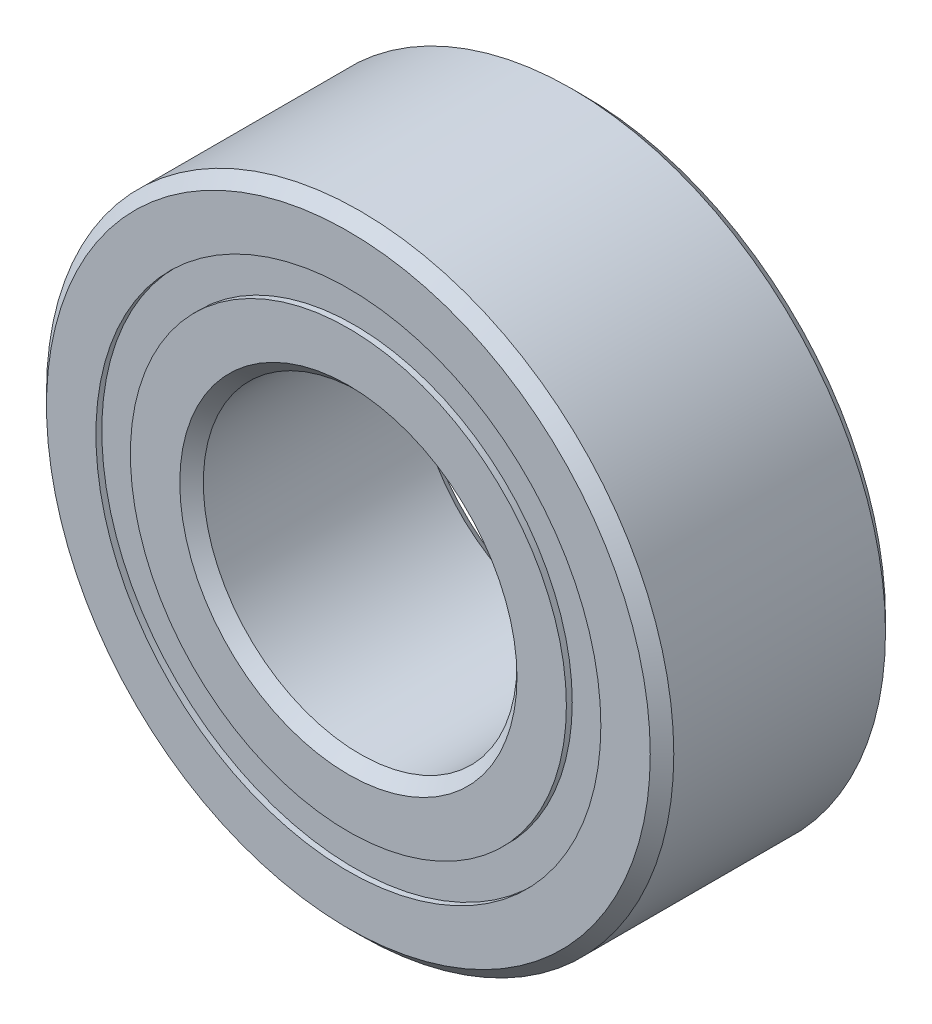
ISO-10303-21;
HEADER;
FILE_DESCRIPTION(('STEP AP214'),'2;1');
FILE_NAME('part.step','',(''),(''),'','','');
FILE_SCHEMA(('AUTOMOTIVE_DESIGN { 1 0 10303 214 1 1 1 1 }'));
ENDSEC;
DATA;
#1=APPLICATION_CONTEXT('core data for automotive mechanical design processes');
#2=APPLICATION_PROTOCOL_DEFINITION('international standard','automotive_design',2000,#1);
#3=PRODUCT_CONTEXT('',#1,'mechanical');
#4=PRODUCT('Part','Part','',(#3));
#5=PRODUCT_RELATED_PRODUCT_CATEGORY('part','',(#4));
#6=PRODUCT_DEFINITION_FORMATION('','',#4);
#7=PRODUCT_DEFINITION_CONTEXT('part definition',#1,'design');
#8=PRODUCT_DEFINITION('design','',#6,#7);
#9=PRODUCT_DEFINITION_SHAPE('','',#8);
#10=(LENGTH_UNIT() NAMED_UNIT(*) SI_UNIT(.MILLI.,.METRE.));
#11=(NAMED_UNIT(*) PLANE_ANGLE_UNIT() SI_UNIT($,.RADIAN.));
#12=(NAMED_UNIT(*) SI_UNIT($,.STERADIAN.) SOLID_ANGLE_UNIT());
#13=UNCERTAINTY_MEASURE_WITH_UNIT(LENGTH_MEASURE(1.E-05),#10,'distance_accuracy_value','');
#14=(GEOMETRIC_REPRESENTATION_CONTEXT(3) GLOBAL_UNCERTAINTY_ASSIGNED_CONTEXT((#13)) GLOBAL_UNIT_ASSIGNED_CONTEXT((#10,
#11,#12)) REPRESENTATION_CONTEXT('',''));
#15=CARTESIAN_POINT('',(0.,0.,0.));
#16=DIRECTION('',(0.,0.,1.));
#17=DIRECTION('',(1.,0.,0.));
#18=AXIS2_PLACEMENT_3D('',#15,#16,#17);
#19=CARTESIAN_POINT('',(0.,5.1114010989011,-2.2621875));
#20=DIRECTION('',(0.,0.,1.));
#21=DIRECTION('',(1.,0.,0.));
#22=AXIS2_PLACEMENT_3D('',#19,#20,#21);
#23=PLANE('',#22);
#24=CARTESIAN_POINT('',(0.,0.,-2.2621875));
#25=DIRECTION('',(0.,0.,1.));
#26=DIRECTION('',(1.,0.,0.));
#27=AXIS2_PLACEMENT_3D('',#24,#25,#26);
#28=CIRCLE('',#27,5.1114010989011);
#29=CARTESIAN_POINT('',(5.1114010989011,0.,-2.2621875));
#30=VERTEX_POINT('',#29);
#31=EDGE_CURVE('E60',#30,#30,#28,.T.);
#32=ORIENTED_EDGE('',*,*,#31,.F.);
#33=EDGE_LOOP('',(#32));
#34=FACE_BOUND('',#33,.T.);
#35=CARTESIAN_POINT('',(0.,0.,-2.2621875));
#36=DIRECTION('',(0.,0.,1.));
#37=DIRECTION('',(1.,0.,0.));
#38=AXIS2_PLACEMENT_3D('',#35,#36,#37);
#39=CIRCLE('',#38,4.4135989010989);
#40=CARTESIAN_POINT('',(4.4135989010989,0.,-2.2621875));
#41=VERTEX_POINT('',#40);
#42=EDGE_CURVE('E11',#41,#41,#39,.T.);
#43=ORIENTED_EDGE('',*,*,#42,.T.);
#44=EDGE_LOOP('',(#43));
#45=FACE_BOUND('',#44,.T.);
#46=ADVANCED_FACE('F46',(#34,#45),#23,.F.);
#47=CARTESIAN_POINT('',(0.,0.,2.38125));
#48=DIRECTION('',(0.,0.,1.));
#49=DIRECTION('',(1.,0.,0.));
#50=AXIS2_PLACEMENT_3D('',#47,#48,#49);
#51=CYLINDRICAL_SURFACE('',#50,4.4135989010989);
#52=ORIENTED_EDGE('',*,*,#42,.F.);
#53=EDGE_LOOP('',(#52));
#54=FACE_BOUND('',#53,.T.);
#55=CARTESIAN_POINT('',(0.,0.,-1.11436144103197));
#56=DIRECTION('',(0.,0.,1.));
#57=DIRECTION('',(1.,0.,0.));
#58=AXIS2_PLACEMENT_3D('',#55,#56,#57);
#59=CIRCLE('',#58,4.4135989010989);
#60=CARTESIAN_POINT('',(4.4135989010989,0.,-1.11436144103197));
#61=VERTEX_POINT('',#60);
#62=EDGE_CURVE('E52',#61,#61,#59,.T.);
#63=ORIENTED_EDGE('',*,*,#62,.T.);
#64=EDGE_LOOP('',(#63));
#65=FACE_BOUND('',#64,.T.);
#66=ADVANCED_FACE('F69',(#54,#65),#51,.F.);
#67=CARTESIAN_POINT('',(0.,5.1114010989011,-1.11436144103197));
#68=DIRECTION('',(0.,0.,-1.));
#69=DIRECTION('',(-1.,0.,0.));
#70=AXIS2_PLACEMENT_3D('',#67,#68,#69);
#71=PLANE('',#70);
#72=ORIENTED_EDGE('',*,*,#62,.F.);
#73=EDGE_LOOP('',(#72));
#74=FACE_BOUND('',#73,.T.);
#75=CARTESIAN_POINT('',(0.,0.,-1.11436144103197));
#76=DIRECTION('',(0.,0.,1.));
#77=DIRECTION('',(1.,0.,0.));
#78=AXIS2_PLACEMENT_3D('',#75,#76,#77);
#79=CIRCLE('',#78,5.1114010989011);
#80=CARTESIAN_POINT('',(5.1114010989011,0.,-1.11436144103197));
#81=VERTEX_POINT('',#80);
#82=EDGE_CURVE('E56',#81,#81,#79,.T.);
#83=ORIENTED_EDGE('',*,*,#82,.T.);
#84=EDGE_LOOP('',(#83));
#85=FACE_BOUND('',#84,.T.);
#86=ADVANCED_FACE('F73',(#74,#85),#71,.F.);
#87=CARTESIAN_POINT('',(0.,0.,2.38125));
#88=DIRECTION('',(0.,0.,1.));
#89=DIRECTION('',(1.,0.,0.));
#90=AXIS2_PLACEMENT_3D('',#87,#88,#89);
#91=CYLINDRICAL_SURFACE('',#90,5.1114010989011);
#92=ORIENTED_EDGE('',*,*,#82,.F.);
#93=EDGE_LOOP('',(#92));
#94=FACE_BOUND('',#93,.T.);
#95=ORIENTED_EDGE('',*,*,#31,.T.);
#96=EDGE_LOOP('',(#95));
#97=FACE_BOUND('',#96,.T.);
#98=ADVANCED_FACE('F66',(#94,#97),#91,.T.);
#99=CLOSED_SHELL('',(#46,#66,#86,#98));
#100=MANIFOLD_SOLID_BREP('B2',#99);
#101=CARTESIAN_POINT('',(0.,5.1114010989011,2.2621875));
#102=DIRECTION('',(0.,0.,-1.));
#103=DIRECTION('',(-1.,0.,0.));
#104=AXIS2_PLACEMENT_3D('',#101,#102,#103);
#105=PLANE('',#104);
#106=CARTESIAN_POINT('',(0.,0.,2.2621875));
#107=DIRECTION('',(0.,0.,1.));
#108=DIRECTION('',(1.,0.,0.));
#109=AXIS2_PLACEMENT_3D('',#106,#107,#108);
#110=CIRCLE('',#109,4.4135989010989);
#111=CARTESIAN_POINT('',(4.4135989010989,0.,2.2621875));
#112=VERTEX_POINT('',#111);
#113=EDGE_CURVE('E45',#112,#112,#110,.T.);
#114=ORIENTED_EDGE('',*,*,#113,.F.);
#115=EDGE_LOOP('',(#114));
#116=FACE_BOUND('',#115,.T.);
#117=CARTESIAN_POINT('',(0.,0.,2.2621875));
#118=DIRECTION('',(0.,0.,1.));
#119=DIRECTION('',(1.,0.,0.));
#120=AXIS2_PLACEMENT_3D('',#117,#118,#119);
#121=CIRCLE('',#120,5.1114010989011);
#122=CARTESIAN_POINT('',(5.1114010989011,0.,2.2621875));
#123=VERTEX_POINT('',#122);
#124=EDGE_CURVE('E128',#123,#123,#121,.T.);
#125=ORIENTED_EDGE('',*,*,#124,.T.);
#126=EDGE_LOOP('',(#125));
#127=FACE_BOUND('',#126,.T.);
#128=ADVANCED_FACE('F114',(#116,#127),#105,.F.);
#129=CARTESIAN_POINT('',(0.,0.,2.38125));
#130=DIRECTION('',(0.,0.,1.));
#131=DIRECTION('',(1.,0.,0.));
#132=AXIS2_PLACEMENT_3D('',#129,#130,#131);
#133=CYLINDRICAL_SURFACE('',#132,4.4135989010989);
#134=CARTESIAN_POINT('',(0.,0.,1.11436144103197));
#135=DIRECTION('',(0.,0.,1.));
#136=DIRECTION('',(1.,0.,0.));
#137=AXIS2_PLACEMENT_3D('',#134,#135,#136);
#138=CIRCLE('',#137,4.4135989010989);
#139=CARTESIAN_POINT('',(4.4135989010989,0.,1.11436144103197));
#140=VERTEX_POINT('',#139);
#141=EDGE_CURVE('E120',#140,#140,#138,.T.);
#142=ORIENTED_EDGE('',*,*,#141,.F.);
#143=EDGE_LOOP('',(#142));
#144=FACE_BOUND('',#143,.T.);
#145=ORIENTED_EDGE('',*,*,#113,.T.);
#146=EDGE_LOOP('',(#145));
#147=FACE_BOUND('',#146,.T.);
#148=ADVANCED_FACE('F143',(#144,#147),#133,.F.);
#149=CARTESIAN_POINT('',(0.,5.1114010989011,1.11436144103197));
#150=DIRECTION('',(0.,0.,1.));
#151=DIRECTION('',(1.,0.,0.));
#152=AXIS2_PLACEMENT_3D('',#149,#150,#151);
#153=PLANE('',#152);
#154=CARTESIAN_POINT('',(0.,0.,1.11436144103197));
#155=DIRECTION('',(0.,0.,1.));
#156=DIRECTION('',(1.,0.,0.));
#157=AXIS2_PLACEMENT_3D('',#154,#155,#156);
#158=CIRCLE('',#157,5.1114010989011);
#159=CARTESIAN_POINT('',(5.1114010989011,0.,1.11436144103197));
#160=VERTEX_POINT('',#159);
#161=EDGE_CURVE('E124',#160,#160,#158,.T.);
#162=ORIENTED_EDGE('',*,*,#161,.F.);
#163=EDGE_LOOP('',(#162));
#164=FACE_BOUND('',#163,.T.);
#165=ORIENTED_EDGE('',*,*,#141,.T.);
#166=EDGE_LOOP('',(#165));
#167=FACE_BOUND('',#166,.T.);
#168=ADVANCED_FACE('F138',(#164,#167),#153,.F.);
#169=CARTESIAN_POINT('',(0.,0.,2.38125));
#170=DIRECTION('',(0.,0.,1.));
#171=DIRECTION('',(1.,0.,0.));
#172=AXIS2_PLACEMENT_3D('',#169,#170,#171);
#173=CYLINDRICAL_SURFACE('',#172,5.1114010989011);
#174=ORIENTED_EDGE('',*,*,#124,.F.);
#175=EDGE_LOOP('',(#174));
#176=FACE_BOUND('',#175,.T.);
#177=ORIENTED_EDGE('',*,*,#161,.T.);
#178=EDGE_LOOP('',(#177));
#179=FACE_BOUND('',#178,.T.);
#180=ADVANCED_FACE('F135',(#176,#179),#173,.T.);
#181=CLOSED_SHELL('',(#128,#148,#168,#180));
#182=MANIFOLD_SOLID_BREP('B6',#181);
#183=CARTESIAN_POINT('',(-2.38124999999995,4.12444598552342,0.));
#184=DIRECTION('',(0.,0.,1.));
#185=DIRECTION('',(-0.499999999999989,0.866025403784445,0.));
#186=AXIS2_PLACEMENT_3D('',#183,#184,#185);
#187=SPHERICAL_SURFACE('',#186,1.11436144103197);
#188=CARTESIAN_POINT('',(-2.38124999999995,4.12444598552342,1.11436144103197));
#189=VERTEX_POINT('',#188);
#190=VERTEX_LOOP('',#189);
#191=FACE_BOUND('',#190,.T.);
#192=ADVANCED_FACE('F182',(#191),#187,.T.);
#193=CLOSED_SHELL('',(#192));
#194=MANIFOLD_SOLID_BREP('B40',#193);
#195=CARTESIAN_POINT('',(-4.12444598552336,2.38125000000005,0.));
#196=DIRECTION('',(0.,0.,1.));
#197=DIRECTION('',(-0.866025403784433,0.50000000000001,0.));
#198=AXIS2_PLACEMENT_3D('',#195,#196,#197);
#199=SPHERICAL_SURFACE('',#198,1.11436144103197);
#200=CARTESIAN_POINT('',(-4.12444598552336,2.38125000000005,1.11436144103197));
#201=VERTEX_POINT('',#200);
#202=VERTEX_LOOP('',#201);
#203=FACE_BOUND('',#202,.T.);
#204=ADVANCED_FACE('F203',(#203),#199,.T.);
#205=CLOSED_SHELL('',(#204));
#206=MANIFOLD_SOLID_BREP('B110',#205);
#207=CARTESIAN_POINT('',(-4.7625,0.,0.));
#208=DIRECTION('',(0.,0.,1.));
#209=DIRECTION('',(-1.,0.,0.));
#210=AXIS2_PLACEMENT_3D('',#207,#208,#209);
#211=SPHERICAL_SURFACE('',#210,1.11436144103197);
#212=CARTESIAN_POINT('',(-4.7625,0.,1.11436144103197));
#213=VERTEX_POINT('',#212);
#214=VERTEX_LOOP('',#213);
#215=FACE_BOUND('',#214,.T.);
#216=ADVANCED_FACE('F224',(#215),#211,.T.);
#217=CLOSED_SHELL('',(#216));
#218=MANIFOLD_SOLID_BREP('B178',#217);
#219=CARTESIAN_POINT('',(-4.12444598552341,-2.38124999999996,0.));
#220=DIRECTION('',(0.,0.,1.));
#221=DIRECTION('',(-0.866025403784443,-0.499999999999992,0.));
#222=AXIS2_PLACEMENT_3D('',#219,#220,#221);
#223=SPHERICAL_SURFACE('',#222,1.11436144103197);
#224=CARTESIAN_POINT('',(-4.12444598552341,-2.38124999999996,1.11436144103197));
#225=VERTEX_POINT('',#224);
#226=VERTEX_LOOP('',#225);
#227=FACE_BOUND('',#226,.T.);
#228=ADVANCED_FACE('F245',(#227),#223,.T.);
#229=CLOSED_SHELL('',(#228));
#230=MANIFOLD_SOLID_BREP('B199',#229);
#231=CARTESIAN_POINT('',(-2.38125000000003,-4.12444598552337,0.));
#232=DIRECTION('',(0.,0.,1.));
#233=DIRECTION('',(-0.500000000000007,-0.866025403784435,0.));
#234=AXIS2_PLACEMENT_3D('',#231,#232,#233);
#235=SPHERICAL_SURFACE('',#234,1.11436144103197);
#236=CARTESIAN_POINT('',(-2.38125000000003,-4.12444598552337,1.11436144103197));
#237=VERTEX_POINT('',#236);
#238=VERTEX_LOOP('',#237);
#239=FACE_BOUND('',#238,.T.);
#240=ADVANCED_FACE('F266',(#239),#235,.T.);
#241=CLOSED_SHELL('',(#240));
#242=MANIFOLD_SOLID_BREP('B220',#241);
#243=CARTESIAN_POINT('',(0.,-4.7625,0.));
#244=DIRECTION('',(0.,0.,1.));
#245=DIRECTION('',(0.,-1.,0.));
#246=AXIS2_PLACEMENT_3D('',#243,#244,#245);
#247=SPHERICAL_SURFACE('',#246,1.11436144103197);
#248=CARTESIAN_POINT('',(0.,-4.7625,1.11436144103197));
#249=VERTEX_POINT('',#248);
#250=VERTEX_LOOP('',#249);
#251=FACE_BOUND('',#250,.T.);
#252=ADVANCED_FACE('F287',(#251),#247,.T.);
#253=CLOSED_SHELL('',(#252));
#254=MANIFOLD_SOLID_BREP('B241',#253);
#255=CARTESIAN_POINT('',(2.38124999999998,-4.1244459855234,0.));
#256=DIRECTION('',(0.,0.,1.));
#257=DIRECTION('',(0.499999999999995,-0.866025403784442,0.));
#258=AXIS2_PLACEMENT_3D('',#255,#256,#257);
#259=SPHERICAL_SURFACE('',#258,1.11436144103197);
#260=CARTESIAN_POINT('',(2.38124999999998,-4.1244459855234,1.11436144103197));
#261=VERTEX_POINT('',#260);
#262=VERTEX_LOOP('',#261);
#263=FACE_BOUND('',#262,.T.);
#264=ADVANCED_FACE('F308',(#263),#259,.T.);
#265=CLOSED_SHELL('',(#264));
#266=MANIFOLD_SOLID_BREP('B262',#265);
#267=CARTESIAN_POINT('',(4.12444598552338,-2.38125000000002,0.));
#268=DIRECTION('',(0.,0.,1.));
#269=DIRECTION('',(0.866025403784436,-0.500000000000004,0.));
#270=AXIS2_PLACEMENT_3D('',#267,#268,#269);
#271=SPHERICAL_SURFACE('',#270,1.11436144103197);
#272=CARTESIAN_POINT('',(4.12444598552338,-2.38125000000002,1.11436144103197));
#273=VERTEX_POINT('',#272);
#274=VERTEX_LOOP('',#273);
#275=FACE_BOUND('',#274,.T.);
#276=ADVANCED_FACE('F329',(#275),#271,.T.);
#277=CLOSED_SHELL('',(#276));
#278=MANIFOLD_SOLID_BREP('B283',#277);
#279=CARTESIAN_POINT('',(4.7625,0.,0.));
#280=DIRECTION('',(0.,0.,1.));
#281=DIRECTION('',(1.,0.,0.));
#282=AXIS2_PLACEMENT_3D('',#279,#280,#281);
#283=SPHERICAL_SURFACE('',#282,1.11436144103197);
#284=CARTESIAN_POINT('',(4.7625,0.,1.11436144103197));
#285=VERTEX_POINT('',#284);
#286=VERTEX_LOOP('',#285);
#287=FACE_BOUND('',#286,.T.);
#288=ADVANCED_FACE('F350',(#287),#283,.T.);
#289=CLOSED_SHELL('',(#288));
#290=MANIFOLD_SOLID_BREP('B304',#289);
#291=CARTESIAN_POINT('',(4.12444598552339,2.38124999999999,0.));
#292=DIRECTION('',(0.,0.,1.));
#293=DIRECTION('',(0.86602540378444,0.499999999999998,0.));
#294=AXIS2_PLACEMENT_3D('',#291,#292,#293);
#295=SPHERICAL_SURFACE('',#294,1.11436144103197);
#296=CARTESIAN_POINT('',(4.12444598552339,2.38124999999999,1.11436144103197));
#297=VERTEX_POINT('',#296);
#298=VERTEX_LOOP('',#297);
#299=FACE_BOUND('',#298,.T.);
#300=ADVANCED_FACE('F371',(#299),#295,.T.);
#301=CLOSED_SHELL('',(#300));
#302=MANIFOLD_SOLID_BREP('B325',#301);
#303=CARTESIAN_POINT('',(2.38125,4.12444598552339,0.));
#304=DIRECTION('',(0.,0.,1.));
#305=DIRECTION('',(0.500000000000001,0.866025403784438,0.));
#306=AXIS2_PLACEMENT_3D('',#303,#304,#305);
#307=SPHERICAL_SURFACE('',#306,1.11436144103197);
#308=CARTESIAN_POINT('',(2.38125,4.12444598552339,1.11436144103197));
#309=VERTEX_POINT('',#308);
#310=VERTEX_LOOP('',#309);
#311=FACE_BOUND('',#310,.T.);
#312=ADVANCED_FACE('F392',(#311),#307,.T.);
#313=CLOSED_SHELL('',(#312));
#314=MANIFOLD_SOLID_BREP('B346',#313);
#315=CARTESIAN_POINT('',(0.,4.7625,0.));
#316=DIRECTION('',(0.,0.,1.));
#317=DIRECTION('',(0.,1.,0.));
#318=AXIS2_PLACEMENT_3D('',#315,#316,#317);
#319=SPHERICAL_SURFACE('',#318,1.11436144103197);
#320=CARTESIAN_POINT('',(0.,4.7625,1.11436144103197));
#321=VERTEX_POINT('',#320);
#322=VERTEX_LOOP('',#321);
#323=FACE_BOUND('',#322,.T.);
#324=ADVANCED_FACE('F415',(#323),#319,.T.);
#325=CLOSED_SHELL('',(#324));
#326=MANIFOLD_SOLID_BREP('B367',#325);
#327=CARTESIAN_POINT('',(0.,4.4135989010989,2.38125));
#328=DIRECTION('',(0.,0.,-1.));
#329=DIRECTION('',(-1.,0.,0.));
#330=AXIS2_PLACEMENT_3D('',#327,#328,#329);
#331=PLANE('',#330);
#332=CARTESIAN_POINT('',(0.,0.,2.38125));
#333=DIRECTION('',(0.,0.,1.));
#334=DIRECTION('',(1.,0.,0.));
#335=AXIS2_PLACEMENT_3D('',#332,#333,#334);
#336=CIRCLE('',#335,3.413125);
#337=CARTESIAN_POINT('',(3.413125,0.,2.38125));
#338=VERTEX_POINT('',#337);
#339=EDGE_CURVE('E463',#338,#338,#336,.T.);
#340=ORIENTED_EDGE('',*,*,#339,.F.);
#341=EDGE_LOOP('',(#340));
#342=FACE_BOUND('',#341,.T.);
#343=CARTESIAN_POINT('',(0.,0.,2.38125));
#344=DIRECTION('',(0.,0.,1.));
#345=DIRECTION('',(1.,0.,0.));
#346=AXIS2_PLACEMENT_3D('',#343,#344,#345);
#347=CIRCLE('',#346,4.4135989010989);
#348=CARTESIAN_POINT('',(4.4135989010989,0.,2.38125));
#349=VERTEX_POINT('',#348);
#350=EDGE_CURVE('E414',#349,#349,#347,.T.);
#351=ORIENTED_EDGE('',*,*,#350,.T.);
#352=EDGE_LOOP('',(#351));
#353=FACE_BOUND('',#352,.T.);
#354=ADVANCED_FACE('F435',(#342,#353),#331,.F.);
#355=CARTESIAN_POINT('',(0.,0.,2.38125));
#356=DIRECTION('',(0.,0.,1.));
#357=DIRECTION('',(1.,0.,0.));
#358=AXIS2_PLACEMENT_3D('',#355,#356,#357);
#359=CYLINDRICAL_SURFACE('',#358,4.4135989010989);
#360=ORIENTED_EDGE('',*,*,#350,.F.);
#361=EDGE_LOOP('',(#360));
#362=FACE_BOUND('',#361,.T.);
#363=CARTESIAN_POINT('',(0.,0.,1.05833333333333));
#364=DIRECTION('',(0.,0.,1.));
#365=DIRECTION('',(1.,0.,0.));
#366=AXIS2_PLACEMENT_3D('',#363,#364,#365);
#367=CIRCLE('',#366,4.4135989010989);
#368=CARTESIAN_POINT('',(4.4135989010989,0.,1.05833333333333));
#369=VERTEX_POINT('',#368);
#370=EDGE_CURVE('E441',#369,#369,#367,.T.);
#371=ORIENTED_EDGE('',*,*,#370,.T.);
#372=EDGE_LOOP('',(#371));
#373=FACE_BOUND('',#372,.T.);
#374=ADVANCED_FACE('F470',(#362,#373),#359,.T.);
#375=CARTESIAN_POINT('',(0.,0.,0.));
#376=DIRECTION('',(0.,0.,1.));
#377=DIRECTION('',(1.,0.,0.));
#378=AXIS2_PLACEMENT_3D('',#375,#376,#377);
#379=TOROIDAL_SURFACE('',#378,4.76249999999999,1.11436144103196);
#380=ORIENTED_EDGE('',*,*,#370,.F.);
#381=EDGE_LOOP('',(#380));
#382=FACE_BOUND('',#381,.T.);
#383=CARTESIAN_POINT('',(0.,0.,-1.05833333333334));
#384=DIRECTION('',(0.,0.,1.));
#385=DIRECTION('',(1.,0.,0.));
#386=AXIS2_PLACEMENT_3D('',#383,#384,#385);
#387=CIRCLE('',#386,4.4135989010989);
#388=CARTESIAN_POINT('',(4.4135989010989,0.,-1.05833333333334));
#389=VERTEX_POINT('',#388);
#390=EDGE_CURVE('E445',#389,#389,#387,.T.);
#391=ORIENTED_EDGE('',*,*,#390,.T.);
#392=EDGE_LOOP('',(#391));
#393=FACE_BOUND('',#392,.T.);
#394=ADVANCED_FACE('F474',(#382,#393),#379,.F.);
#395=CARTESIAN_POINT('',(0.,0.,2.38125));
#396=DIRECTION('',(0.,0.,1.));
#397=DIRECTION('',(1.,0.,0.));
#398=AXIS2_PLACEMENT_3D('',#395,#396,#397);
#399=CYLINDRICAL_SURFACE('',#398,4.4135989010989);
#400=ORIENTED_EDGE('',*,*,#390,.F.);
#401=EDGE_LOOP('',(#400));
#402=FACE_BOUND('',#401,.T.);
#403=CARTESIAN_POINT('',(0.,0.,-2.38125));
#404=DIRECTION('',(0.,0.,1.));
#405=DIRECTION('',(1.,0.,0.));
#406=AXIS2_PLACEMENT_3D('',#403,#404,#405);
#407=CIRCLE('',#406,4.4135989010989);
#408=CARTESIAN_POINT('',(4.4135989010989,0.,-2.38125));
#409=VERTEX_POINT('',#408);
#410=EDGE_CURVE('E449',#409,#409,#407,.T.);
#411=ORIENTED_EDGE('',*,*,#410,.T.);
#412=EDGE_LOOP('',(#411));
#413=FACE_BOUND('',#412,.T.);
#414=ADVANCED_FACE('F479',(#402,#413),#399,.T.);
#415=CARTESIAN_POINT('',(0.,3.413125,-2.38125));
#416=DIRECTION('',(0.,0.,1.));
#417=DIRECTION('',(1.,0.,0.));
#418=AXIS2_PLACEMENT_3D('',#415,#416,#417);
#419=PLANE('',#418);
#420=ORIENTED_EDGE('',*,*,#410,.F.);
#421=EDGE_LOOP('',(#420));
#422=FACE_BOUND('',#421,.T.);
#423=CARTESIAN_POINT('',(0.,0.,-2.38125));
#424=DIRECTION('',(0.,0.,1.));
#425=DIRECTION('',(1.,0.,0.));
#426=AXIS2_PLACEMENT_3D('',#423,#424,#425);
#427=CIRCLE('',#426,3.413125);
#428=CARTESIAN_POINT('',(3.413125,0.,-2.38125));
#429=VERTEX_POINT('',#428);
#430=EDGE_CURVE('E454',#429,#429,#427,.T.);
#431=ORIENTED_EDGE('',*,*,#430,.T.);
#432=EDGE_LOOP('',(#431));
#433=FACE_BOUND('',#432,.T.);
#434=ADVANCED_FACE('F485',(#422,#433),#419,.F.);
#435=CARTESIAN_POINT('',(0.,0.,-2.143125));
#436=DIRECTION('',(0.,0.,-1.));
#437=DIRECTION('',(-1.,0.,0.));
#438=AXIS2_PLACEMENT_3D('',#435,#436,#437);
#439=CONICAL_SURFACE('',#438,3.175,0.785398163397451);
#440=ORIENTED_EDGE('',*,*,#430,.F.);
#441=EDGE_LOOP('',(#440));
#442=FACE_BOUND('',#441,.T.);
#443=CARTESIAN_POINT('',(0.,0.,-2.143125));
#444=DIRECTION('',(0.,0.,1.));
#445=DIRECTION('',(1.,0.,0.));
#446=AXIS2_PLACEMENT_3D('',#443,#444,#445);
#447=CIRCLE('',#446,3.175);
#448=CARTESIAN_POINT('',(3.175,0.,-2.143125));
#449=VERTEX_POINT('',#448);
#450=EDGE_CURVE('E457',#449,#449,#447,.T.);
#451=ORIENTED_EDGE('',*,*,#450,.T.);
#452=EDGE_LOOP('',(#451));
#453=FACE_BOUND('',#452,.T.);
#454=ADVANCED_FACE('F489',(#442,#453),#439,.F.);
#455=CARTESIAN_POINT('',(0.,0.,2.38125));
#456=DIRECTION('',(0.,0.,1.));
#457=DIRECTION('',(1.,0.,0.));
#458=AXIS2_PLACEMENT_3D('',#455,#456,#457);
#459=CYLINDRICAL_SURFACE('',#458,3.175);
#460=ORIENTED_EDGE('',*,*,#450,.F.);
#461=EDGE_LOOP('',(#460));
#462=FACE_BOUND('',#461,.T.);
#463=CARTESIAN_POINT('',(0.,0.,2.143125));
#464=DIRECTION('',(0.,0.,1.));
#465=DIRECTION('',(1.,0.,0.));
#466=AXIS2_PLACEMENT_3D('',#463,#464,#465);
#467=CIRCLE('',#466,3.175);
#468=CARTESIAN_POINT('',(3.175,0.,2.143125));
#469=VERTEX_POINT('',#468);
#470=EDGE_CURVE('E460',#469,#469,#467,.T.);
#471=ORIENTED_EDGE('',*,*,#470,.T.);
#472=EDGE_LOOP('',(#471));
#473=FACE_BOUND('',#472,.T.);
#474=ADVANCED_FACE('F493',(#462,#473),#459,.F.);
#475=CARTESIAN_POINT('',(0.,0.,2.38125));
#476=DIRECTION('',(0.,0.,1.));
#477=DIRECTION('',(1.,0.,0.));
#478=AXIS2_PLACEMENT_3D('',#475,#476,#477);
#479=CONICAL_SURFACE('',#478,3.413125,0.785398163397446);
#480=ORIENTED_EDGE('',*,*,#470,.F.);
#481=EDGE_LOOP('',(#480));
#482=FACE_BOUND('',#481,.T.);
#483=ORIENTED_EDGE('',*,*,#339,.T.);
#484=EDGE_LOOP('',(#483));
#485=FACE_BOUND('',#484,.T.);
#486=ADVANCED_FACE('F467',(#482,#485),#479,.F.);
#487=CLOSED_SHELL('',(#354,#374,#394,#414,#434,#454,#474,#486));
#488=MANIFOLD_SOLID_BREP('B388',#487);
#489=CARTESIAN_POINT('',(0.,0.,2.143125));
#490=DIRECTION('',(0.,0.,-1.));
#491=DIRECTION('',(-1.,0.,0.));
#492=AXIS2_PLACEMENT_3D('',#489,#490,#491);
#493=CONICAL_SURFACE('',#492,6.35,0.785398163397447);
#494=CARTESIAN_POINT('',(0.,0.,2.38125));
#495=DIRECTION('',(0.,0.,1.));
#496=DIRECTION('',(1.,0.,0.));
#497=AXIS2_PLACEMENT_3D('',#494,#495,#496);
#498=CIRCLE('',#497,6.111875);
#499=CARTESIAN_POINT('',(6.111875,0.,2.38125));
#500=VERTEX_POINT('',#499);
#501=EDGE_CURVE('E585',#500,#500,#498,.T.);
#502=ORIENTED_EDGE('',*,*,#501,.F.);
#503=EDGE_LOOP('',(#502));
#504=FACE_BOUND('',#503,.T.);
#505=CARTESIAN_POINT('',(0.,0.,2.143125));
#506=DIRECTION('',(0.,0.,1.));
#507=DIRECTION('',(1.,0.,0.));
#508=AXIS2_PLACEMENT_3D('',#505,#506,#507);
#509=CIRCLE('',#508,6.35);
#510=CARTESIAN_POINT('',(6.35,0.,2.143125));
#511=VERTEX_POINT('',#510);
#512=EDGE_CURVE('E434',#511,#511,#509,.T.);
#513=ORIENTED_EDGE('',*,*,#512,.T.);
#514=EDGE_LOOP('',(#513));
#515=FACE_BOUND('',#514,.T.);
#516=ADVANCED_FACE('F557',(#504,#515),#493,.T.);
#517=CARTESIAN_POINT('',(0.,0.,2.38125));
#518=DIRECTION('',(0.,0.,1.));
#519=DIRECTION('',(1.,0.,0.));
#520=AXIS2_PLACEMENT_3D('',#517,#518,#519);
#521=CYLINDRICAL_SURFACE('',#520,6.35);
#522=ORIENTED_EDGE('',*,*,#512,.F.);
#523=EDGE_LOOP('',(#522));
#524=FACE_BOUND('',#523,.T.);
#525=CARTESIAN_POINT('',(0.,0.,-2.143125));
#526=DIRECTION('',(0.,0.,1.));
#527=DIRECTION('',(1.,0.,0.));
#528=AXIS2_PLACEMENT_3D('',#525,#526,#527);
#529=CIRCLE('',#528,6.35);
#530=CARTESIAN_POINT('',(6.35,0.,-2.143125));
#531=VERTEX_POINT('',#530);
#532=EDGE_CURVE('E563',#531,#531,#529,.T.);
#533=ORIENTED_EDGE('',*,*,#532,.T.);
#534=EDGE_LOOP('',(#533));
#535=FACE_BOUND('',#534,.T.);
#536=ADVANCED_FACE('F592',(#524,#535),#521,.T.);
#537=CARTESIAN_POINT('',(0.,0.,-2.38125));
#538=DIRECTION('',(0.,0.,1.));
#539=DIRECTION('',(1.,0.,0.));
#540=AXIS2_PLACEMENT_3D('',#537,#538,#539);
#541=CONICAL_SURFACE('',#540,6.111875,0.785398163397447);
#542=ORIENTED_EDGE('',*,*,#532,.F.);
#543=EDGE_LOOP('',(#542));
#544=FACE_BOUND('',#543,.T.);
#545=CARTESIAN_POINT('',(0.,0.,-2.38125));
#546=DIRECTION('',(0.,0.,1.));
#547=DIRECTION('',(1.,0.,0.));
#548=AXIS2_PLACEMENT_3D('',#545,#546,#547);
#549=CIRCLE('',#548,6.111875);
#550=CARTESIAN_POINT('',(6.111875,0.,-2.38125));
#551=VERTEX_POINT('',#550);
#552=EDGE_CURVE('E567',#551,#551,#549,.T.);
#553=ORIENTED_EDGE('',*,*,#552,.T.);
#554=EDGE_LOOP('',(#553));
#555=FACE_BOUND('',#554,.T.);
#556=ADVANCED_FACE('F596',(#544,#555),#541,.T.);
#557=CARTESIAN_POINT('',(0.,6.111875,-2.38125));
#558=DIRECTION('',(0.,0.,1.));
#559=DIRECTION('',(1.,0.,0.));
#560=AXIS2_PLACEMENT_3D('',#557,#558,#559);
#561=PLANE('',#560);
#562=ORIENTED_EDGE('',*,*,#552,.F.);
#563=EDGE_LOOP('',(#562));
#564=FACE_BOUND('',#563,.T.);
#565=CARTESIAN_POINT('',(0.,0.,-2.38125));
#566=DIRECTION('',(0.,0.,1.));
#567=DIRECTION('',(1.,0.,0.));
#568=AXIS2_PLACEMENT_3D('',#565,#566,#567);
#569=CIRCLE('',#568,5.1114010989011);
#570=CARTESIAN_POINT('',(5.1114010989011,0.,-2.38125));
#571=VERTEX_POINT('',#570);
#572=EDGE_CURVE('E571',#571,#571,#569,.T.);
#573=ORIENTED_EDGE('',*,*,#572,.T.);
#574=EDGE_LOOP('',(#573));
#575=FACE_BOUND('',#574,.T.);
#576=ADVANCED_FACE('F601',(#564,#575),#561,.F.);
#577=CARTESIAN_POINT('',(0.,0.,2.38125));
#578=DIRECTION('',(0.,0.,1.));
#579=DIRECTION('',(1.,0.,0.));
#580=AXIS2_PLACEMENT_3D('',#577,#578,#579);
#581=CYLINDRICAL_SURFACE('',#580,5.1114010989011);
#582=ORIENTED_EDGE('',*,*,#572,.F.);
#583=EDGE_LOOP('',(#582));
#584=FACE_BOUND('',#583,.T.);
#585=CARTESIAN_POINT('',(0.,0.,-1.05833333333333));
#586=DIRECTION('',(0.,0.,1.));
#587=DIRECTION('',(1.,0.,0.));
#588=AXIS2_PLACEMENT_3D('',#585,#586,#587);
#589=CIRCLE('',#588,5.1114010989011);
#590=CARTESIAN_POINT('',(5.1114010989011,0.,-1.05833333333333));
#591=VERTEX_POINT('',#590);
#592=EDGE_CURVE('E576',#591,#591,#589,.T.);
#593=ORIENTED_EDGE('',*,*,#592,.T.);
#594=EDGE_LOOP('',(#593));
#595=FACE_BOUND('',#594,.T.);
#596=ADVANCED_FACE('F607',(#584,#595),#581,.F.);
#597=CARTESIAN_POINT('',(0.,0.,0.));
#598=DIRECTION('',(0.,0.,1.));
#599=DIRECTION('',(1.,0.,0.));
#600=AXIS2_PLACEMENT_3D('',#597,#598,#599);
#601=TOROIDAL_SURFACE('',#600,4.7625,1.11436144103197);
#602=ORIENTED_EDGE('',*,*,#592,.F.);
#603=EDGE_LOOP('',(#602));
#604=FACE_BOUND('',#603,.T.);
#605=CARTESIAN_POINT('',(0.,0.,1.05833333333333));
#606=DIRECTION('',(0.,0.,1.));
#607=DIRECTION('',(1.,0.,0.));
#608=AXIS2_PLACEMENT_3D('',#605,#606,#607);
#609=CIRCLE('',#608,5.1114010989011);
#610=CARTESIAN_POINT('',(5.1114010989011,0.,1.05833333333333));
#611=VERTEX_POINT('',#610);
#612=EDGE_CURVE('E579',#611,#611,#609,.T.);
#613=ORIENTED_EDGE('',*,*,#612,.T.);
#614=EDGE_LOOP('',(#613));
#615=FACE_BOUND('',#614,.T.);
#616=ADVANCED_FACE('F611',(#604,#615),#601,.F.);
#617=CARTESIAN_POINT('',(0.,0.,2.38125));
#618=DIRECTION('',(0.,0.,1.));
#619=DIRECTION('',(1.,0.,0.));
#620=AXIS2_PLACEMENT_3D('',#617,#618,#619);
#621=CYLINDRICAL_SURFACE('',#620,5.1114010989011);
#622=ORIENTED_EDGE('',*,*,#612,.F.);
#623=EDGE_LOOP('',(#622));
#624=FACE_BOUND('',#623,.T.);
#625=CARTESIAN_POINT('',(0.,0.,2.38125));
#626=DIRECTION('',(0.,0.,1.));
#627=DIRECTION('',(1.,0.,0.));
#628=AXIS2_PLACEMENT_3D('',#625,#626,#627);
#629=CIRCLE('',#628,5.1114010989011);
#630=CARTESIAN_POINT('',(5.1114010989011,0.,2.38125));
#631=VERTEX_POINT('',#630);
#632=EDGE_CURVE('E582',#631,#631,#629,.T.);
#633=ORIENTED_EDGE('',*,*,#632,.T.);
#634=EDGE_LOOP('',(#633));
#635=FACE_BOUND('',#634,.T.);
#636=ADVANCED_FACE('F615',(#624,#635),#621,.F.);
#637=CARTESIAN_POINT('',(0.,6.111875,2.38125));
#638=DIRECTION('',(0.,0.,-1.));
#639=DIRECTION('',(-1.,0.,0.));
#640=AXIS2_PLACEMENT_3D('',#637,#638,#639);
#641=PLANE('',#640);
#642=ORIENTED_EDGE('',*,*,#632,.F.);
#643=EDGE_LOOP('',(#642));
#644=FACE_BOUND('',#643,.T.);
#645=ORIENTED_EDGE('',*,*,#501,.T.);
#646=EDGE_LOOP('',(#645));
#647=FACE_BOUND('',#646,.T.);
#648=ADVANCED_FACE('F589',(#644,#647),#641,.F.);
#649=CLOSED_SHELL('',(#516,#536,#556,#576,#596,#616,#636,#648));
#650=MANIFOLD_SOLID_BREP('B409',#649);
#651=ADVANCED_BREP_SHAPE_REPRESENTATION('',(#18,#100,#182,#194,#206,#218,#230,#242,#254,#266,
#278,#290,#302,#314,#326,#488,#650),#14);
#652=SHAPE_DEFINITION_REPRESENTATION(#9,#651);
ENDSEC;
END-ISO-10303-21;
